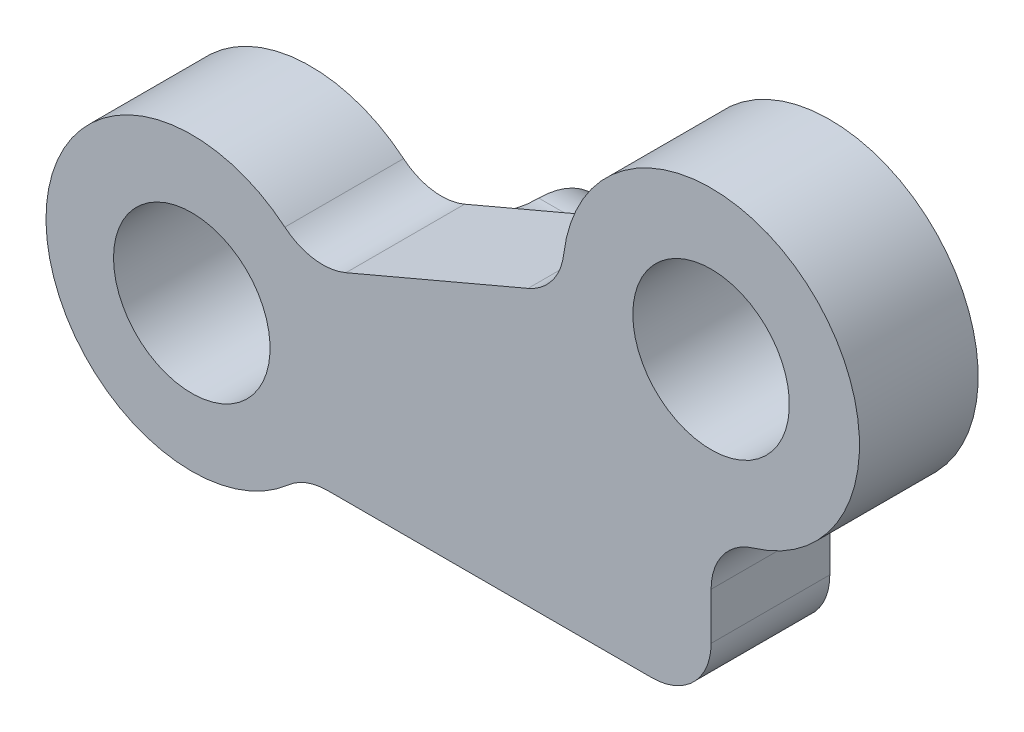
ISO-10303-21;
HEADER;
FILE_DESCRIPTION(('STEP AP214'),'2;1');
FILE_NAME('part.step','',(''),(''),'','','');
FILE_SCHEMA(('AUTOMOTIVE_DESIGN { 1 0 10303 214 1 1 1 1 }'));
ENDSEC;
DATA;
#1=APPLICATION_CONTEXT('core data for automotive mechanical design processes');
#2=APPLICATION_PROTOCOL_DEFINITION('international standard','automotive_design',2000,#1);
#3=PRODUCT_CONTEXT('',#1,'mechanical');
#4=PRODUCT('Part','Part','',(#3));
#5=PRODUCT_RELATED_PRODUCT_CATEGORY('part','',(#4));
#6=PRODUCT_DEFINITION_FORMATION('','',#4);
#7=PRODUCT_DEFINITION_CONTEXT('part definition',#1,'design');
#8=PRODUCT_DEFINITION('design','',#6,#7);
#9=PRODUCT_DEFINITION_SHAPE('','',#8);
#10=(LENGTH_UNIT() NAMED_UNIT(*) SI_UNIT(.MILLI.,.METRE.));
#11=(NAMED_UNIT(*) PLANE_ANGLE_UNIT() SI_UNIT($,.RADIAN.));
#12=(NAMED_UNIT(*) SI_UNIT($,.STERADIAN.) SOLID_ANGLE_UNIT());
#13=UNCERTAINTY_MEASURE_WITH_UNIT(LENGTH_MEASURE(1.E-05),#10,'distance_accuracy_value','');
#14=(GEOMETRIC_REPRESENTATION_CONTEXT(3) GLOBAL_UNCERTAINTY_ASSIGNED_CONTEXT((#13)) GLOBAL_UNIT_ASSIGNED_CONTEXT((#10,
#11,#12)) REPRESENTATION_CONTEXT('',''));
#15=CARTESIAN_POINT('',(0.,0.,0.));
#16=DIRECTION('',(0.,0.,1.));
#17=DIRECTION('',(1.,0.,0.));
#18=AXIS2_PLACEMENT_3D('',#15,#16,#17);
#19=CARTESIAN_POINT('',(39.3405929872107,26.4759472363339,4.));
#20=DIRECTION('',(0.,0.,-1.));
#21=DIRECTION('',(-1.,0.,0.));
#22=AXIS2_PLACEMENT_3D('',#19,#20,#21);
#23=CYLINDRICAL_SURFACE('',#22,4.91303849973908);
#24=CARTESIAN_POINT('',(39.3405929872107,26.4759472363339,0.));
#25=DIRECTION('',(0.,0.,-1.));
#26=DIRECTION('',(-1.,0.,0.));
#27=AXIS2_PLACEMENT_3D('',#24,#25,#26);
#28=CIRCLE('',#27,4.91303849973908);
#29=CARTESIAN_POINT('',(42.5911839602965,22.7919812178138,0.));
#30=VERTEX_POINT('',#29);
#31=CARTESIAN_POINT('',(42.4759512366879,30.2584696681713,0.));
#32=VERTEX_POINT('',#31);
#33=EDGE_CURVE('E200',#30,#32,#28,.T.);
#34=ORIENTED_EDGE('',*,*,#33,.F.);
#35=DIRECTION('',(0.,0.,-1.));
#36=VECTOR('',#35,1.);
#37=CARTESIAN_POINT('',(42.5911839602965,22.7919812178138,4.));
#38=LINE('',#37,#36);
#39=CARTESIAN_POINT('',(42.5911839602965,22.7919812178138,4.));
#40=VERTEX_POINT('',#39);
#41=EDGE_CURVE('E249',#30,#40,#38,.F.);
#42=ORIENTED_EDGE('',*,*,#41,.T.);
#43=CARTESIAN_POINT('',(39.3405929872107,26.4759472363339,4.));
#44=DIRECTION('',(0.,0.,-1.));
#45=DIRECTION('',(-1.,0.,0.));
#46=AXIS2_PLACEMENT_3D('',#43,#44,#45);
#47=CIRCLE('',#46,4.91303849973908);
#48=CARTESIAN_POINT('',(42.4759512366879,30.2584696681713,4.));
#49=VERTEX_POINT('',#48);
#50=EDGE_CURVE('E201',#40,#49,#47,.T.);
#51=ORIENTED_EDGE('',*,*,#50,.T.);
#52=DIRECTION('',(0.,0.,-1.));
#53=VECTOR('',#52,1.);
#54=CARTESIAN_POINT('',(42.4759512366879,30.2584696681713,4.));
#55=LINE('',#54,#53);
#56=EDGE_CURVE('E246',#49,#32,#55,.T.);
#57=ORIENTED_EDGE('',*,*,#56,.T.);
#58=EDGE_LOOP('',(#34,#42,#51,#57));
#59=FACE_BOUND('',#58,.T.);
#60=ADVANCED_FACE('F34',(#59),#23,.T.);
#61=CARTESIAN_POINT('',(56.8390710383438,23.2923121153975,4.));
#62=DIRECTION('',(0.,-1.,0.));
#63=DIRECTION('',(0.,0.,-1.));
#64=AXIS2_PLACEMENT_3D('',#61,#62,#63);
#65=PLANE('',#64);
#66=DIRECTION('',(-1.,0.,0.));
#67=VECTOR('',#66,1.);
#68=CARTESIAN_POINT('',(56.8390710383438,23.2923121153975,4.));
#69=LINE('',#68,#67);
#70=CARTESIAN_POINT('',(54.8390710383438,23.2923121153975,4.));
#71=VERTEX_POINT('',#70);
#72=CARTESIAN_POINT('',(43.9144347238549,23.2923121153975,4.));
#73=VERTEX_POINT('',#72);
#74=EDGE_CURVE('E214',#71,#73,#69,.T.);
#75=ORIENTED_EDGE('',*,*,#74,.T.);
#76=DIRECTION('',(0.,0.,1.));
#77=VECTOR('',#76,1.);
#78=CARTESIAN_POINT('',(43.9144347238549,23.2923121153975,0.));
#79=LINE('',#78,#77);
#80=CARTESIAN_POINT('',(43.9144347238549,23.2923121153975,0.));
#81=VERTEX_POINT('',#80);
#82=EDGE_CURVE('E243',#73,#81,#79,.F.);
#83=ORIENTED_EDGE('',*,*,#82,.T.);
#84=DIRECTION('',(-1.,0.,0.));
#85=VECTOR('',#84,1.);
#86=CARTESIAN_POINT('',(56.8390710383438,23.2923121153975,0.));
#87=LINE('',#86,#85);
#88=CARTESIAN_POINT('',(45.,23.2923121153975,0.));
#89=VERTEX_POINT('',#88);
#90=EDGE_CURVE('E229',#89,#81,#87,.T.);
#91=ORIENTED_EDGE('',*,*,#90,.F.);
#92=DIRECTION('',(1.,0.,0.));
#93=VECTOR('',#92,1.);
#94=CARTESIAN_POINT('',(36.7838954531117,23.2923121153975,0.));
#95=LINE('',#94,#93);
#96=CARTESIAN_POINT('',(47.,23.2923121153975,0.));
#97=VERTEX_POINT('',#96);
#98=EDGE_CURVE('E179',#89,#97,#95,.T.);
#99=ORIENTED_EDGE('',*,*,#98,.T.);
#100=CARTESIAN_POINT('',(54.8390710383438,23.2923121153975,0.));
#101=VERTEX_POINT('',#100);
#102=EDGE_CURVE('E205',#101,#97,#87,.T.);
#103=ORIENTED_EDGE('',*,*,#102,.F.);
#104=DIRECTION('',(0.,0.,-1.));
#105=VECTOR('',#104,1.);
#106=CARTESIAN_POINT('',(54.8390710383438,23.2923121153975,4.));
#107=LINE('',#106,#105);
#108=EDGE_CURVE('E241',#101,#71,#107,.F.);
#109=ORIENTED_EDGE('',*,*,#108,.T.);
#110=EDGE_LOOP('',(#75,#83,#91,#99,#103,#109));
#111=FACE_BOUND('',#110,.T.);
#112=ADVANCED_FACE('F314',(#111),#65,.T.);
#113=CARTESIAN_POINT('',(56.8390710383438,28.5799198029011,4.));
#114=DIRECTION('',(1.,0.,0.));
#115=DIRECTION('',(0.,0.,-1.));
#116=AXIS2_PLACEMENT_3D('',#113,#114,#115);
#117=PLANE('',#116);
#118=DIRECTION('',(0.,-1.,0.));
#119=VECTOR('',#118,1.);
#120=CARTESIAN_POINT('',(56.8390710383438,28.5799198029011,4.));
#121=LINE('',#120,#119);
#122=CARTESIAN_POINT('',(56.8390710383438,26.8717158704018,4.));
#123=VERTEX_POINT('',#122);
#124=CARTESIAN_POINT('',(56.8390710383438,25.2923121153975,4.));
#125=VERTEX_POINT('',#124);
#126=EDGE_CURVE('E211',#123,#125,#121,.T.);
#127=ORIENTED_EDGE('',*,*,#126,.T.);
#128=DIRECTION('',(0.,0.,-1.));
#129=VECTOR('',#128,1.);
#130=CARTESIAN_POINT('',(56.8390710383438,25.2923121153975,4.));
#131=LINE('',#130,#129);
#132=CARTESIAN_POINT('',(56.8390710383438,25.2923121153975,0.));
#133=VERTEX_POINT('',#132);
#134=EDGE_CURVE('E253',#125,#133,#131,.T.);
#135=ORIENTED_EDGE('',*,*,#134,.T.);
#136=DIRECTION('',(0.,-1.,0.));
#137=VECTOR('',#136,1.);
#138=CARTESIAN_POINT('',(56.8390710383438,28.5799198029011,0.));
#139=LINE('',#138,#137);
#140=CARTESIAN_POINT('',(56.8390710383438,26.8717158704018,0.));
#141=VERTEX_POINT('',#140);
#142=EDGE_CURVE('E226',#141,#133,#139,.T.);
#143=ORIENTED_EDGE('',*,*,#142,.F.);
#144=DIRECTION('',(0.,0.,1.));
#145=VECTOR('',#144,1.);
#146=CARTESIAN_POINT('',(56.8390710383438,26.8717158704018,4.));
#147=LINE('',#146,#145);
#148=EDGE_CURVE('E251',#141,#123,#147,.T.);
#149=ORIENTED_EDGE('',*,*,#148,.T.);
#150=EDGE_LOOP('',(#127,#135,#143,#149));
#151=FACE_BOUND('',#150,.T.);
#152=ADVANCED_FACE('F279',(#151),#117,.T.);
#153=CARTESIAN_POINT('',(56.8390710383438,33.5799198029011,4.));
#154=DIRECTION('',(0.,0.,-1.));
#155=DIRECTION('',(-1.,0.,0.));
#156=AXIS2_PLACEMENT_3D('',#153,#154,#155);
#157=CYLINDRICAL_SURFACE('',#156,5.);
#158=CARTESIAN_POINT('',(56.8390710383438,33.5799198029011,0.));
#159=DIRECTION('',(0.,0.,-1.));
#160=DIRECTION('',(-1.,0.,0.));
#161=AXIS2_PLACEMENT_3D('',#158,#159,#160);
#162=CIRCLE('',#161,5.);
#163=CARTESIAN_POINT('',(51.8742444876987,34.171947945821,0.));
#164=VERTEX_POINT('',#163);
#165=CARTESIAN_POINT('',(58.2676424669152,28.7883455654016,0.));
#166=VERTEX_POINT('',#165);
#167=EDGE_CURVE('E223',#164,#166,#162,.T.);
#168=ORIENTED_EDGE('',*,*,#167,.F.);
#169=DIRECTION('',(0.,0.,-1.));
#170=VECTOR('',#169,1.);
#171=CARTESIAN_POINT('',(51.8742444876987,34.171947945821,4.));
#172=LINE('',#171,#170);
#173=CARTESIAN_POINT('',(51.8742444876987,34.171947945821,4.));
#174=VERTEX_POINT('',#173);
#175=EDGE_CURVE('E239',#164,#174,#172,.F.);
#176=ORIENTED_EDGE('',*,*,#175,.T.);
#177=CARTESIAN_POINT('',(56.8390710383438,33.5799198029011,4.));
#178=DIRECTION('',(0.,0.,-1.));
#179=DIRECTION('',(-1.,0.,0.));
#180=AXIS2_PLACEMENT_3D('',#177,#178,#179);
#181=CIRCLE('',#180,5.);
#182=CARTESIAN_POINT('',(58.2676424669152,28.7883455654016,4.));
#183=VERTEX_POINT('',#182);
#184=EDGE_CURVE('E208',#174,#183,#181,.T.);
#185=ORIENTED_EDGE('',*,*,#184,.T.);
#186=DIRECTION('',(0.,0.,-1.));
#187=VECTOR('',#186,1.);
#188=CARTESIAN_POINT('',(58.2676424669152,28.7883455654016,4.));
#189=LINE('',#188,#187);
#190=EDGE_CURVE('E236',#183,#166,#189,.T.);
#191=ORIENTED_EDGE('',*,*,#190,.T.);
#192=EDGE_LOOP('',(#168,#176,#185,#191));
#193=FACE_BOUND('',#192,.T.);
#194=ADVANCED_FACE('F289',(#193),#157,.T.);
#195=CARTESIAN_POINT('',(43.2731470006214,29.4209372586473,4.));
#196=DIRECTION('',(-0.39148245786292,0.920185571059233,0.));
#197=DIRECTION('',(-0.920185571059233,-0.39148245786292,0.));
#198=AXIS2_PLACEMENT_3D('',#195,#196,#197);
#199=PLANE('',#198);
#200=DIRECTION('',(0.920185571059233,0.39148245786292,0.));
#201=VECTOR('',#200,1.);
#202=CARTESIAN_POINT('',(43.2731470006214,29.4209372586473,4.));
#203=LINE('',#202,#201);
#204=CARTESIAN_POINT('',(44.5352579721019,29.9578879789702,4.));
#205=VERTEX_POINT('',#204);
#206=CARTESIAN_POINT('',(50.6712787831665,32.5683880608705,4.));
#207=VERTEX_POINT('',#206);
#208=EDGE_CURVE('E204',#205,#207,#203,.T.);
#209=ORIENTED_EDGE('',*,*,#208,.T.);
#210=DIRECTION('',(0.,0.,1.));
#211=VECTOR('',#210,1.);
#212=CARTESIAN_POINT('',(50.6712787831665,32.5683880608705,0.));
#213=LINE('',#212,#211);
#214=CARTESIAN_POINT('',(50.6712787831665,32.5683880608705,0.));
#215=VERTEX_POINT('',#214);
#216=EDGE_CURVE('E233',#207,#215,#213,.F.);
#217=ORIENTED_EDGE('',*,*,#216,.T.);
#218=DIRECTION('',(0.920185571059233,0.39148245786292,0.));
#219=VECTOR('',#218,1.);
#220=CARTESIAN_POINT('',(43.2731470006214,29.4209372586473,0.));
#221=LINE('',#220,#219);
#222=CARTESIAN_POINT('',(44.5352579721019,29.9578879789702,0.));
#223=VERTEX_POINT('',#222);
#224=EDGE_CURVE('E220',#223,#215,#221,.T.);
#225=ORIENTED_EDGE('',*,*,#224,.F.);
#226=DIRECTION('',(0.,0.,1.));
#227=VECTOR('',#226,1.);
#228=CARTESIAN_POINT('',(44.5352579721019,29.9578879789702,4.));
#229=LINE('',#228,#227);
#230=EDGE_CURVE('E217',#223,#205,#229,.T.);
#231=ORIENTED_EDGE('',*,*,#230,.T.);
#232=EDGE_LOOP('',(#209,#217,#225,#231));
#233=FACE_BOUND('',#232,.T.);
#234=ADVANCED_FACE('F297',(#233),#199,.T.);
#235=CARTESIAN_POINT('',(39.3405929872107,26.4759472363339,4.));
#236=DIRECTION('',(0.,0.,-1.));
#237=DIRECTION('',(-1.,0.,0.));
#238=AXIS2_PLACEMENT_3D('',#235,#236,#237);
#239=PLANE('',#238);
#240=CARTESIAN_POINT('',(39.3405929872107,26.4759472363339,4.));
#241=DIRECTION('',(0.,0.,-1.));
#242=DIRECTION('',(-1.,0.,0.));
#243=AXIS2_PLACEMENT_3D('',#240,#241,#242);
#244=CIRCLE('',#243,2.63750000000001);
#245=CARTESIAN_POINT('',(36.7030929872106,26.4759472363339,4.));
#246=VERTEX_POINT('',#245);
#247=EDGE_CURVE('E191',#246,#246,#244,.T.);
#248=ORIENTED_EDGE('',*,*,#247,.T.);
#249=EDGE_LOOP('',(#248));
#250=FACE_BOUND('',#249,.T.);
#251=CARTESIAN_POINT('',(56.8390710383438,33.5799198029011,4.));
#252=DIRECTION('',(0.,0.,-1.));
#253=DIRECTION('',(-1.,0.,0.));
#254=AXIS2_PLACEMENT_3D('',#251,#252,#253);
#255=CIRCLE('',#254,2.63750000000001);
#256=CARTESIAN_POINT('',(54.2015710383438,33.5799198029011,4.));
#257=VERTEX_POINT('',#256);
#258=EDGE_CURVE('E197',#257,#257,#255,.T.);
#259=ORIENTED_EDGE('',*,*,#258,.T.);
#260=EDGE_LOOP('',(#259));
#261=FACE_BOUND('',#260,.T.);
#262=ORIENTED_EDGE('',*,*,#74,.F.);
#263=CARTESIAN_POINT('',(54.8390710383438,25.2923121153975,4.));
#264=DIRECTION('',(0.,0.,-1.));
#265=DIRECTION('',(-1.,0.,0.));
#266=AXIS2_PLACEMENT_3D('',#263,#264,#265);
#267=CIRCLE('',#266,2.);
#268=EDGE_CURVE('E258',#71,#125,#267,.F.);
#269=ORIENTED_EDGE('',*,*,#268,.T.);
#270=ORIENTED_EDGE('',*,*,#126,.F.);
#271=CARTESIAN_POINT('',(58.8390710383438,26.8717158704018,4.));
#272=DIRECTION('',(0.,0.,-1.));
#273=DIRECTION('',(-1.,0.,0.));
#274=AXIS2_PLACEMENT_3D('',#271,#272,#273);
#275=CIRCLE('',#274,2.);
#276=EDGE_CURVE('E11',#123,#183,#275,.T.);
#277=ORIENTED_EDGE('',*,*,#276,.T.);
#278=ORIENTED_EDGE('',*,*,#184,.F.);
#279=CARTESIAN_POINT('',(49.8883138674406,34.4087592029889,4.));
#280=DIRECTION('',(0.,0.,-1.));
#281=DIRECTION('',(-1.,0.,0.));
#282=AXIS2_PLACEMENT_3D('',#279,#280,#281);
#283=CIRCLE('',#282,2.);
#284=EDGE_CURVE('E262',#174,#207,#283,.T.);
#285=ORIENTED_EDGE('',*,*,#284,.T.);
#286=ORIENTED_EDGE('',*,*,#208,.F.);
#287=CARTESIAN_POINT('',(43.752293056376,31.7982591210886,4.));
#288=DIRECTION('',(0.,0.,-1.));
#289=DIRECTION('',(-1.,0.,0.));
#290=AXIS2_PLACEMENT_3D('',#287,#288,#289);
#291=CIRCLE('',#290,2.);
#292=EDGE_CURVE('E270',#205,#49,#291,.T.);
#293=ORIENTED_EDGE('',*,*,#292,.T.);
#294=ORIENTED_EDGE('',*,*,#50,.F.);
#295=CARTESIAN_POINT('',(43.9144347238549,21.2923121153975,4.));
#296=DIRECTION('',(0.,0.,-1.));
#297=DIRECTION('',(-1.,0.,0.));
#298=AXIS2_PLACEMENT_3D('',#295,#296,#297);
#299=CIRCLE('',#298,2.);
#300=EDGE_CURVE('E266',#40,#73,#299,.T.);
#301=ORIENTED_EDGE('',*,*,#300,.T.);
#302=EDGE_LOOP('',(#262,#269,#270,#277,#278,#285,#286,#293,#294,#301));
#303=FACE_BOUND('',#302,.T.);
#304=ADVANCED_FACE('F286',(#250,#261,#303),#239,.F.);
#305=CARTESIAN_POINT('',(39.3405929872107,26.4759472363339,0.));
#306=DIRECTION('',(0.,0.,-1.));
#307=DIRECTION('',(-1.,0.,0.));
#308=AXIS2_PLACEMENT_3D('',#305,#306,#307);
#309=PLANE('',#308);
#310=DIRECTION('',(0.,1.,0.));
#311=VECTOR('',#310,1.);
#312=CARTESIAN_POINT('',(45.,23.2923121153975,0.));
#313=LINE('',#312,#311);
#314=CARTESIAN_POINT('',(45.,30.1441050305794,0.));
#315=VERTEX_POINT('',#314);
#316=EDGE_CURVE('E53',#89,#315,#313,.T.);
#317=ORIENTED_EDGE('',*,*,#316,.F.);
#318=ORIENTED_EDGE('',*,*,#90,.T.);
#319=CARTESIAN_POINT('',(43.9144347238549,21.2923121153975,0.));
#320=DIRECTION('',(0.,0.,-1.));
#321=DIRECTION('',(-1.,0.,0.));
#322=AXIS2_PLACEMENT_3D('',#319,#320,#321);
#323=CIRCLE('',#322,2.);
#324=EDGE_CURVE('E264',#81,#30,#323,.F.);
#325=ORIENTED_EDGE('',*,*,#324,.T.);
#326=ORIENTED_EDGE('',*,*,#33,.T.);
#327=CARTESIAN_POINT('',(43.752293056376,31.7982591210886,0.));
#328=DIRECTION('',(0.,0.,-1.));
#329=DIRECTION('',(-1.,0.,0.));
#330=AXIS2_PLACEMENT_3D('',#327,#328,#329);
#331=CIRCLE('',#330,2.);
#332=EDGE_CURVE('E268',#32,#223,#331,.F.);
#333=ORIENTED_EDGE('',*,*,#332,.T.);
#334=ORIENTED_EDGE('',*,*,#224,.T.);
#335=CARTESIAN_POINT('',(49.8883138674406,34.4087592029889,0.));
#336=DIRECTION('',(0.,0.,-1.));
#337=DIRECTION('',(-1.,0.,0.));
#338=AXIS2_PLACEMENT_3D('',#335,#336,#337);
#339=CIRCLE('',#338,2.);
#340=EDGE_CURVE('E260',#215,#164,#339,.F.);
#341=ORIENTED_EDGE('',*,*,#340,.T.);
#342=ORIENTED_EDGE('',*,*,#167,.T.);
#343=CARTESIAN_POINT('',(58.8390710383438,26.8717158704018,0.));
#344=DIRECTION('',(0.,0.,-1.));
#345=DIRECTION('',(-1.,0.,0.));
#346=AXIS2_PLACEMENT_3D('',#343,#344,#345);
#347=CIRCLE('',#346,2.);
#348=EDGE_CURVE('E42',#166,#141,#347,.F.);
#349=ORIENTED_EDGE('',*,*,#348,.T.);
#350=ORIENTED_EDGE('',*,*,#142,.T.);
#351=CARTESIAN_POINT('',(54.8390710383438,25.2923121153975,0.));
#352=DIRECTION('',(0.,0.,-1.));
#353=DIRECTION('',(-1.,0.,0.));
#354=AXIS2_PLACEMENT_3D('',#351,#352,#353);
#355=CIRCLE('',#354,2.);
#356=EDGE_CURVE('E256',#133,#101,#355,.T.);
#357=ORIENTED_EDGE('',*,*,#356,.T.);
#358=ORIENTED_EDGE('',*,*,#102,.T.);
#359=DIRECTION('',(0.,-1.,0.));
#360=VECTOR('',#359,1.);
#361=CARTESIAN_POINT('',(47.,23.2923121153975,0.));
#362=LINE('',#361,#360);
#363=CARTESIAN_POINT('',(47.,30.1441050305794,0.));
#364=VERTEX_POINT('',#363);
#365=EDGE_CURVE('E145',#364,#97,#362,.T.);
#366=ORIENTED_EDGE('',*,*,#365,.F.);
#367=DIRECTION('',(1.,0.,0.));
#368=VECTOR('',#367,1.);
#369=CARTESIAN_POINT('',(36.7838954531117,30.1441050305794,0.));
#370=LINE('',#369,#368);
#371=EDGE_CURVE('E49',#315,#364,#370,.T.);
#372=ORIENTED_EDGE('',*,*,#371,.F.);
#373=EDGE_LOOP('',(#317,#318,#325,#326,#333,#334,#341,#342,#349,#350,#357,#358,#366,#372));
#374=FACE_BOUND('',#373,.T.);
#375=CARTESIAN_POINT('',(39.3405929872107,26.4759472363339,0.));
#376=DIRECTION('',(0.,0.,-1.));
#377=DIRECTION('',(-1.,0.,0.));
#378=AXIS2_PLACEMENT_3D('',#375,#376,#377);
#379=CIRCLE('',#378,2.63750000000001);
#380=CARTESIAN_POINT('',(36.7030929872106,26.4759472363339,0.));
#381=VERTEX_POINT('',#380);
#382=EDGE_CURVE('E187',#381,#381,#379,.T.);
#383=ORIENTED_EDGE('',*,*,#382,.F.);
#384=EDGE_LOOP('',(#383));
#385=FACE_BOUND('',#384,.T.);
#386=CARTESIAN_POINT('',(56.8390710383438,33.5799198029011,0.));
#387=DIRECTION('',(0.,0.,-1.));
#388=DIRECTION('',(-1.,0.,0.));
#389=AXIS2_PLACEMENT_3D('',#386,#387,#388);
#390=CIRCLE('',#389,2.63750000000001);
#391=CARTESIAN_POINT('',(54.2015710383438,33.5799198029011,0.));
#392=VERTEX_POINT('',#391);
#393=EDGE_CURVE('E194',#392,#392,#390,.T.);
#394=ORIENTED_EDGE('',*,*,#393,.F.);
#395=EDGE_LOOP('',(#394));
#396=FACE_BOUND('',#395,.T.);
#397=ADVANCED_FACE('F272',(#374,#385,#396),#309,.T.);
#398=CARTESIAN_POINT('',(56.8390710383438,33.5799198029011,0.));
#399=DIRECTION('',(0.,0.,-1.));
#400=DIRECTION('',(-1.,0.,0.));
#401=AXIS2_PLACEMENT_3D('',#398,#399,#400);
#402=CYLINDRICAL_SURFACE('',#401,2.63750000000001);
#403=ORIENTED_EDGE('',*,*,#258,.F.);
#404=EDGE_LOOP('',(#403));
#405=FACE_BOUND('',#404,.T.);
#406=ORIENTED_EDGE('',*,*,#393,.T.);
#407=EDGE_LOOP('',(#406));
#408=FACE_BOUND('',#407,.T.);
#409=ADVANCED_FACE('F351',(#405,#408),#402,.F.);
#410=CARTESIAN_POINT('',(39.3405929872107,26.4759472363339,0.));
#411=DIRECTION('',(0.,0.,-1.));
#412=DIRECTION('',(-1.,0.,0.));
#413=AXIS2_PLACEMENT_3D('',#410,#411,#412);
#414=CYLINDRICAL_SURFACE('',#413,2.63750000000001);
#415=ORIENTED_EDGE('',*,*,#247,.F.);
#416=EDGE_LOOP('',(#415));
#417=FACE_BOUND('',#416,.T.);
#418=ORIENTED_EDGE('',*,*,#382,.T.);
#419=EDGE_LOOP('',(#418));
#420=FACE_BOUND('',#419,.T.);
#421=ADVANCED_FACE('F348',(#417,#420),#414,.F.);
#422=CARTESIAN_POINT('',(49.8883138674406,34.4087592029889,4.));
#423=DIRECTION('',(0.,0.,-1.));
#424=DIRECTION('',(-1.,0.,0.));
#425=AXIS2_PLACEMENT_3D('',#422,#423,#424);
#426=CYLINDRICAL_SURFACE('',#425,2.);
#427=ORIENTED_EDGE('',*,*,#284,.F.);
#428=ORIENTED_EDGE('',*,*,#175,.F.);
#429=ORIENTED_EDGE('',*,*,#340,.F.);
#430=ORIENTED_EDGE('',*,*,#216,.F.);
#431=EDGE_LOOP('',(#427,#428,#429,#430));
#432=FACE_BOUND('',#431,.T.);
#433=ADVANCED_FACE('F292',(#432),#426,.F.);
#434=CARTESIAN_POINT('',(43.9144347238549,21.2923121153975,4.));
#435=DIRECTION('',(0.,0.,-1.));
#436=DIRECTION('',(-1.,0.,0.));
#437=AXIS2_PLACEMENT_3D('',#434,#435,#436);
#438=CYLINDRICAL_SURFACE('',#437,2.);
#439=ORIENTED_EDGE('',*,*,#300,.F.);
#440=ORIENTED_EDGE('',*,*,#41,.F.);
#441=ORIENTED_EDGE('',*,*,#324,.F.);
#442=ORIENTED_EDGE('',*,*,#82,.F.);
#443=EDGE_LOOP('',(#439,#440,#441,#442));
#444=FACE_BOUND('',#443,.T.);
#445=ADVANCED_FACE('F310',(#444),#438,.F.);
#446=CARTESIAN_POINT('',(43.752293056376,31.7982591210886,4.));
#447=DIRECTION('',(0.,0.,-1.));
#448=DIRECTION('',(-1.,0.,0.));
#449=AXIS2_PLACEMENT_3D('',#446,#447,#448);
#450=CYLINDRICAL_SURFACE('',#449,2.);
#451=ORIENTED_EDGE('',*,*,#292,.F.);
#452=ORIENTED_EDGE('',*,*,#230,.F.);
#453=ORIENTED_EDGE('',*,*,#332,.F.);
#454=ORIENTED_EDGE('',*,*,#56,.F.);
#455=EDGE_LOOP('',(#451,#452,#453,#454));
#456=FACE_BOUND('',#455,.T.);
#457=ADVANCED_FACE('F301',(#456),#450,.F.);
#458=CARTESIAN_POINT('',(54.8390710383438,25.2923121153975,4.));
#459=DIRECTION('',(0.,0.,-1.));
#460=DIRECTION('',(-1.,0.,0.));
#461=AXIS2_PLACEMENT_3D('',#458,#459,#460);
#462=CYLINDRICAL_SURFACE('',#461,2.);
#463=ORIENTED_EDGE('',*,*,#268,.F.);
#464=ORIENTED_EDGE('',*,*,#108,.F.);
#465=ORIENTED_EDGE('',*,*,#356,.F.);
#466=ORIENTED_EDGE('',*,*,#134,.F.);
#467=EDGE_LOOP('',(#463,#464,#465,#466));
#468=FACE_BOUND('',#467,.T.);
#469=ADVANCED_FACE('F318',(#468),#462,.T.);
#470=CARTESIAN_POINT('',(58.8390710383438,26.8717158704018,4.));
#471=DIRECTION('',(0.,0.,-1.));
#472=DIRECTION('',(-1.,0.,0.));
#473=AXIS2_PLACEMENT_3D('',#470,#471,#472);
#474=CYLINDRICAL_SURFACE('',#473,2.);
#475=ORIENTED_EDGE('',*,*,#276,.F.);
#476=ORIENTED_EDGE('',*,*,#148,.F.);
#477=ORIENTED_EDGE('',*,*,#348,.F.);
#478=ORIENTED_EDGE('',*,*,#190,.F.);
#479=EDGE_LOOP('',(#475,#476,#477,#478));
#480=FACE_BOUND('',#479,.T.);
#481=ADVANCED_FACE('F36',(#480),#474,.F.);
#482=CARTESIAN_POINT('',(36.7838954531117,26.8495531149059,-2.03401673716158));
#483=DIRECTION('',(1.,0.,0.));
#484=DIRECTION('',(0.,0.,-1.));
#485=AXIS2_PLACEMENT_3D('',#482,#483,#484);
#486=CYLINDRICAL_SURFACE('',#485,2.5);
#487=CARTESIAN_POINT('',(45.,26.8495531149059,-2.03401673716158));
#488=DIRECTION('',(1.,0.,0.));
#489=DIRECTION('',(0.,0.,-1.));
#490=AXIS2_PLACEMENT_3D('',#487,#488,#489);
#491=CIRCLE('',#490,2.5);
#492=CARTESIAN_POINT('',(45.,29.3495531149059,-2.03401673716158));
#493=VERTEX_POINT('',#492);
#494=CARTESIAN_POINT('',(45.,24.3495531149059,-2.03401673716158));
#495=VERTEX_POINT('',#494);
#496=EDGE_CURVE('E188',#493,#495,#491,.F.);
#497=ORIENTED_EDGE('',*,*,#496,.F.);
#498=DIRECTION('',(1.,0.,0.));
#499=VECTOR('',#498,1.);
#500=CARTESIAN_POINT('',(36.7838954531117,29.3495531149059,-2.03401673716158));
#501=LINE('',#500,#499);
#502=CARTESIAN_POINT('',(47.,29.3495531149059,-2.03401673716158));
#503=VERTEX_POINT('',#502);
#504=EDGE_CURVE('E144',#493,#503,#501,.T.);
#505=ORIENTED_EDGE('',*,*,#504,.T.);
#506=CARTESIAN_POINT('',(47.,26.8495531149059,-2.03401673716158));
#507=DIRECTION('',(1.,0.,0.));
#508=DIRECTION('',(0.,0.,-1.));
#509=AXIS2_PLACEMENT_3D('',#506,#507,#508);
#510=CIRCLE('',#509,2.5);
#511=CARTESIAN_POINT('',(47.,24.3495531149059,-2.03401673716158));
#512=VERTEX_POINT('',#511);
#513=EDGE_CURVE('E148',#512,#503,#510,.T.);
#514=ORIENTED_EDGE('',*,*,#513,.F.);
#515=DIRECTION('',(1.,0.,0.));
#516=VECTOR('',#515,1.);
#517=CARTESIAN_POINT('',(36.7838954531117,24.3495531149059,-2.03401673716158));
#518=LINE('',#517,#516);
#519=EDGE_CURVE('E133',#495,#512,#518,.T.);
#520=ORIENTED_EDGE('',*,*,#519,.F.);
#521=EDGE_LOOP('',(#497,#505,#514,#520));
#522=FACE_BOUND('',#521,.T.);
#523=ADVANCED_FACE('F149',(#522),#486,.T.);
#524=CARTESIAN_POINT('',(36.7838954531117,29.3495531149059,-2.03401673716158));
#525=CARTESIAN_POINT('',(36.7838954531117,29.3488282019513,-0.844292257301695));
#526=CARTESIAN_POINT('',(36.7838954531117,30.1441050305794,0.));
#527=B_SPLINE_CURVE_WITH_KNOTS('',2,(#524,#525,#526),.UNSPECIFIED.,.F.,.F.,(3,3),(0.,1.),.UNSPECIFIED.);
#528=DIRECTION('',(1.,0.,0.));
#529=VECTOR('',#528,1.);
#530=SURFACE_OF_LINEAR_EXTRUSION('',#527,#529);
#531=CARTESIAN_POINT('',(45.,29.3495531149059,-2.03401673716158));
#532=CARTESIAN_POINT('',(45.,29.3488282019513,-0.844292257301695));
#533=CARTESIAN_POINT('',(45.,30.1441050305794,0.));
#534=B_SPLINE_CURVE_WITH_KNOTS('',2,(#531,#532,#533),.UNSPECIFIED.,.F.,.F.,(3,3),(0.,1.),.UNSPECIFIED.);
#535=EDGE_CURVE('E181',#315,#493,#534,.F.);
#536=ORIENTED_EDGE('',*,*,#535,.F.);
#537=ORIENTED_EDGE('',*,*,#371,.T.);
#538=CARTESIAN_POINT('',(47.,29.3495531149059,-2.03401673716158));
#539=CARTESIAN_POINT('',(47.,29.3488282019513,-0.844292257301695));
#540=CARTESIAN_POINT('',(47.,30.1441050305794,0.));
#541=B_SPLINE_CURVE_WITH_KNOTS('',2,(#538,#539,#540),.UNSPECIFIED.,.F.,.F.,(3,3),(0.,1.),.UNSPECIFIED.);
#542=EDGE_CURVE('E154',#503,#364,#541,.T.);
#543=ORIENTED_EDGE('',*,*,#542,.F.);
#544=ORIENTED_EDGE('',*,*,#504,.F.);
#545=EDGE_LOOP('',(#536,#537,#543,#544));
#546=FACE_BOUND('',#545,.T.);
#547=ADVANCED_FACE('F321',(#546),#530,.T.);
#548=CARTESIAN_POINT('',(36.7838954531117,23.2923121153975,0.));
#549=CARTESIAN_POINT('',(36.7838954531117,24.3593633184378,-0.725821755532754));
#550=CARTESIAN_POINT('',(36.7838954531117,24.3495531149059,-2.03401673716158));
#551=B_SPLINE_CURVE_WITH_KNOTS('',2,(#548,#549,#550),.UNSPECIFIED.,.F.,.F.,(3,3),(0.,1.),.UNSPECIFIED.);
#552=DIRECTION('',(1.,0.,0.));
#553=VECTOR('',#552,1.);
#554=SURFACE_OF_LINEAR_EXTRUSION('',#551,#553);
#555=CARTESIAN_POINT('',(45.,23.2923121153975,0.));
#556=CARTESIAN_POINT('',(45.,24.3593633184378,-0.725821755532754));
#557=CARTESIAN_POINT('',(45.,24.3495531149059,-2.03401673716158));
#558=B_SPLINE_CURVE_WITH_KNOTS('',2,(#555,#556,#557),.UNSPECIFIED.,.F.,.F.,(3,3),(0.,1.),.UNSPECIFIED.);
#559=EDGE_CURVE('E141',#495,#89,#558,.F.);
#560=ORIENTED_EDGE('',*,*,#559,.F.);
#561=ORIENTED_EDGE('',*,*,#519,.T.);
#562=CARTESIAN_POINT('',(47.,23.2923121153975,0.));
#563=CARTESIAN_POINT('',(47.,24.3593633184378,-0.725821755532754));
#564=CARTESIAN_POINT('',(47.,24.3495531149059,-2.03401673716158));
#565=B_SPLINE_CURVE_WITH_KNOTS('',2,(#562,#563,#564),.UNSPECIFIED.,.F.,.F.,(3,3),(0.,1.),.UNSPECIFIED.);
#566=EDGE_CURVE('E138',#97,#512,#565,.T.);
#567=ORIENTED_EDGE('',*,*,#566,.F.);
#568=ORIENTED_EDGE('',*,*,#98,.F.);
#569=EDGE_LOOP('',(#560,#561,#567,#568));
#570=FACE_BOUND('',#569,.T.);
#571=ADVANCED_FACE('F135',(#570),#554,.T.);
#572=CARTESIAN_POINT('',(47.,24.0901479667947,-0.871415062056772));
#573=DIRECTION('',(-1.,0.,0.));
#574=DIRECTION('',(0.,0.,1.));
#575=AXIS2_PLACEMENT_3D('',#572,#573,#574);
#576=PLANE('',#575);
#577=CARTESIAN_POINT('',(47.,26.8495531149059,-2.03401673716158));
#578=DIRECTION('',(1.,0.,0.));
#579=DIRECTION('',(0.,0.,-1.));
#580=AXIS2_PLACEMENT_3D('',#577,#578,#579);
#581=CIRCLE('',#580,1.5065226661907);
#582=CARTESIAN_POINT('',(47.,26.8495531149059,-3.54053940335228));
#583=VERTEX_POINT('',#582);
#584=EDGE_CURVE('E157',#583,#583,#581,.T.);
#585=ORIENTED_EDGE('',*,*,#584,.F.);
#586=EDGE_LOOP('',(#585));
#587=FACE_BOUND('',#586,.T.);
#588=ORIENTED_EDGE('',*,*,#566,.T.);
#589=ORIENTED_EDGE('',*,*,#513,.T.);
#590=ORIENTED_EDGE('',*,*,#542,.T.);
#591=ORIENTED_EDGE('',*,*,#365,.T.);
#592=EDGE_LOOP('',(#588,#589,#590,#591));
#593=FACE_BOUND('',#592,.T.);
#594=ADVANCED_FACE('F156',(#587,#593),#576,.F.);
#595=CARTESIAN_POINT('',(36.7838954531117,26.8495531149059,-2.03401673716158));
#596=DIRECTION('',(1.,0.,0.));
#597=DIRECTION('',(0.,0.,-1.));
#598=AXIS2_PLACEMENT_3D('',#595,#596,#597);
#599=CYLINDRICAL_SURFACE('',#598,1.5065226661907);
#600=CARTESIAN_POINT('',(45.,26.8495531149059,-2.03401673716158));
#601=DIRECTION('',(1.,0.,0.));
#602=DIRECTION('',(0.,0.,-1.));
#603=AXIS2_PLACEMENT_3D('',#600,#601,#602);
#604=CIRCLE('',#603,1.5065226661907);
#605=CARTESIAN_POINT('',(45.,26.8495531149059,-3.54053940335228));
#606=VERTEX_POINT('',#605);
#607=EDGE_CURVE('E184',#606,#606,#604,.F.);
#608=ORIENTED_EDGE('',*,*,#607,.T.);
#609=EDGE_LOOP('',(#608));
#610=FACE_BOUND('',#609,.T.);
#611=ORIENTED_EDGE('',*,*,#584,.T.);
#612=EDGE_LOOP('',(#611));
#613=FACE_BOUND('',#612,.T.);
#614=ADVANCED_FACE('F391',(#610,#613),#599,.F.);
#615=CARTESIAN_POINT('',(45.,0.,0.));
#616=DIRECTION('',(1.,0.,0.));
#617=DIRECTION('',(0.,0.,-1.));
#618=AXIS2_PLACEMENT_3D('',#615,#616,#617);
#619=PLANE('',#618);
#620=ORIENTED_EDGE('',*,*,#559,.T.);
#621=ORIENTED_EDGE('',*,*,#316,.T.);
#622=ORIENTED_EDGE('',*,*,#535,.T.);
#623=ORIENTED_EDGE('',*,*,#496,.T.);
#624=EDGE_LOOP('',(#620,#621,#622,#623));
#625=FACE_BOUND('',#624,.T.);
#626=ORIENTED_EDGE('',*,*,#607,.F.);
#627=EDGE_LOOP('',(#626));
#628=FACE_BOUND('',#627,.T.);
#629=ADVANCED_FACE('F395',(#625,#628),#619,.F.);
#630=CLOSED_SHELL('',(#60,#112,#152,#194,#234,#304,#397,#409,#421,#433,#445,#457,#469,#481,#523,
#547,#571,#594,#614,#629));
#631=MANIFOLD_SOLID_BREP('B2',#630);
#632=ADVANCED_BREP_SHAPE_REPRESENTATION('',(#18,#631),#14);
#633=SHAPE_DEFINITION_REPRESENTATION(#9,#632);
ENDSEC;
END-ISO-10303-21;
